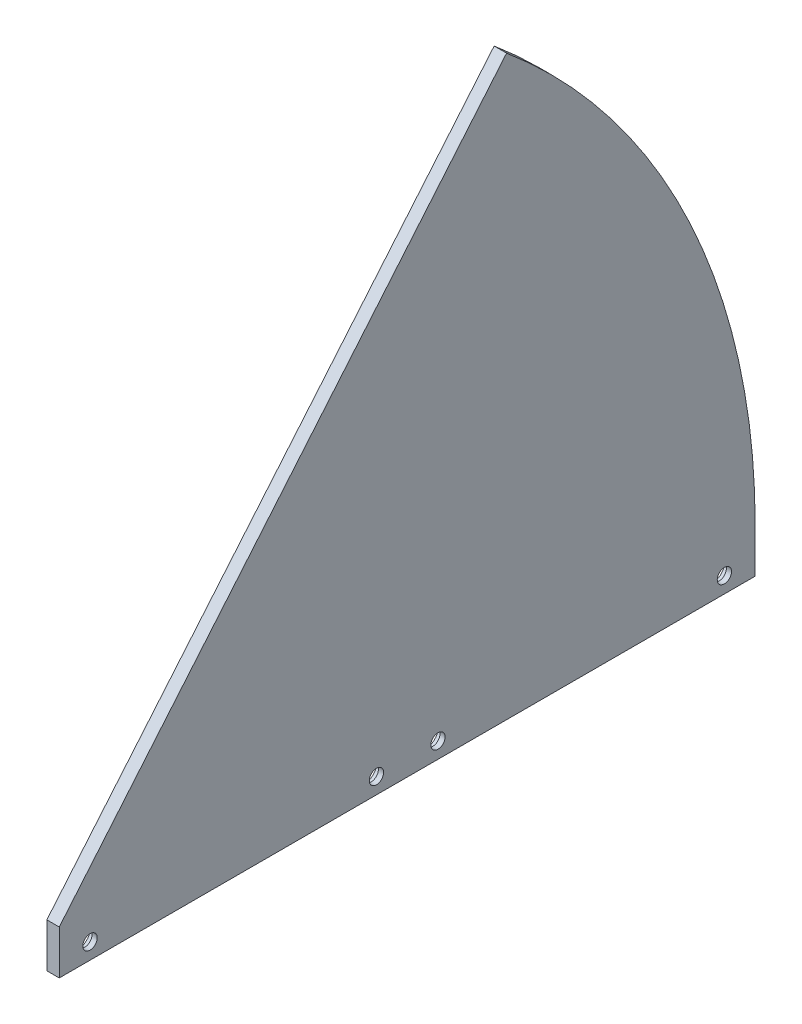
ISO-10303-21;
HEADER;
FILE_DESCRIPTION(('STEP AP214'),'2;1');
FILE_NAME('part.step','',(''),(''),'','','');
FILE_SCHEMA(('AUTOMOTIVE_DESIGN { 1 0 10303 214 1 1 1 1 }'));
ENDSEC;
DATA;
#1=APPLICATION_CONTEXT('core data for automotive mechanical design processes');
#2=APPLICATION_PROTOCOL_DEFINITION('international standard','automotive_design',2000,#1);
#3=PRODUCT_CONTEXT('',#1,'mechanical');
#4=PRODUCT('Part','Part','',(#3));
#5=PRODUCT_RELATED_PRODUCT_CATEGORY('part','',(#4));
#6=PRODUCT_DEFINITION_FORMATION('','',#4);
#7=PRODUCT_DEFINITION_CONTEXT('part definition',#1,'design');
#8=PRODUCT_DEFINITION('design','',#6,#7);
#9=PRODUCT_DEFINITION_SHAPE('','',#8);
#10=(LENGTH_UNIT() NAMED_UNIT(*) SI_UNIT(.MILLI.,.METRE.));
#11=(NAMED_UNIT(*) PLANE_ANGLE_UNIT() SI_UNIT($,.RADIAN.));
#12=(NAMED_UNIT(*) SI_UNIT($,.STERADIAN.) SOLID_ANGLE_UNIT());
#13=UNCERTAINTY_MEASURE_WITH_UNIT(LENGTH_MEASURE(1.E-05),#10,'distance_accuracy_value','');
#14=(GEOMETRIC_REPRESENTATION_CONTEXT(3) GLOBAL_UNCERTAINTY_ASSIGNED_CONTEXT((#13)) GLOBAL_UNIT_ASSIGNED_CONTEXT((#10,
#11,#12)) REPRESENTATION_CONTEXT('',''));
#15=CARTESIAN_POINT('',(0.,0.,0.));
#16=DIRECTION('',(0.,0.,1.));
#17=DIRECTION('',(1.,0.,0.));
#18=AXIS2_PLACEMENT_3D('',#15,#16,#17);
#19=CARTESIAN_POINT('',(0.,-7.239,-7.874));
#20=DIRECTION('',(1.,0.,0.));
#21=DIRECTION('',(0.,0.,-1.));
#22=AXIS2_PLACEMENT_3D('',#19,#20,#21);
#23=CYLINDRICAL_SURFACE('',#22,1.8288);
#24=CARTESIAN_POINT('',(3.175,-7.239,-7.874));
#25=DIRECTION('',(1.,0.,0.));
#26=DIRECTION('',(0.,0.,-1.));
#27=AXIS2_PLACEMENT_3D('',#24,#25,#26);
#28=CIRCLE('',#27,1.8288);
#29=CARTESIAN_POINT('',(3.175,-7.239,-9.7028));
#30=VERTEX_POINT('',#29);
#31=EDGE_CURVE('E169',#30,#30,#28,.T.);
#32=ORIENTED_EDGE('',*,*,#31,.T.);
#33=EDGE_LOOP('',(#32));
#34=FACE_BOUND('',#33,.T.);
#35=CARTESIAN_POINT('',(1.8542,-7.239,-7.874));
#36=DIRECTION('',(-1.,0.,0.));
#37=DIRECTION('',(0.,0.,1.));
#38=AXIS2_PLACEMENT_3D('',#35,#36,#37);
#39=CIRCLE('',#38,1.8288);
#40=CARTESIAN_POINT('',(1.8542,-7.239,-6.0452));
#41=VERTEX_POINT('',#40);
#42=EDGE_CURVE('E37',#41,#41,#39,.F.);
#43=ORIENTED_EDGE('',*,*,#42,.F.);
#44=EDGE_LOOP('',(#43));
#45=FACE_BOUND('',#44,.T.);
#46=ADVANCED_FACE('F33',(#34,#45),#23,.F.);
#47=CARTESIAN_POINT('',(0.,-7.23899999999998,-81.153));
#48=DIRECTION('',(1.,0.,0.));
#49=DIRECTION('',(0.,0.,-1.));
#50=AXIS2_PLACEMENT_3D('',#47,#48,#49);
#51=CYLINDRICAL_SURFACE('',#50,1.8288);
#52=CARTESIAN_POINT('',(3.175,-7.23899999999998,-81.153));
#53=DIRECTION('',(1.,0.,0.));
#54=DIRECTION('',(0.,0.,-1.));
#55=AXIS2_PLACEMENT_3D('',#52,#53,#54);
#56=CIRCLE('',#55,1.8288);
#57=CARTESIAN_POINT('',(3.175,-7.23899999999998,-82.9818));
#58=VERTEX_POINT('',#57);
#59=EDGE_CURVE('E166',#58,#58,#56,.T.);
#60=ORIENTED_EDGE('',*,*,#59,.T.);
#61=EDGE_LOOP('',(#60));
#62=FACE_BOUND('',#61,.T.);
#63=CARTESIAN_POINT('',(1.8542,-7.23899999999998,-81.153));
#64=DIRECTION('',(-1.,0.,0.));
#65=DIRECTION('',(0.,0.,1.));
#66=AXIS2_PLACEMENT_3D('',#63,#64,#65);
#67=CIRCLE('',#66,1.8288);
#68=CARTESIAN_POINT('',(1.8542,-7.23899999999998,-79.3242));
#69=VERTEX_POINT('',#68);
#70=EDGE_CURVE('E208',#69,#69,#67,.F.);
#71=ORIENTED_EDGE('',*,*,#70,.F.);
#72=EDGE_LOOP('',(#71));
#73=FACE_BOUND('',#72,.T.);
#74=ADVANCED_FACE('F291',(#62,#73),#51,.F.);
#75=CARTESIAN_POINT('',(0.,-7.23899999999998,-96.901));
#76=DIRECTION('',(1.,0.,0.));
#77=DIRECTION('',(0.,0.,-1.));
#78=AXIS2_PLACEMENT_3D('',#75,#76,#77);
#79=CYLINDRICAL_SURFACE('',#78,1.8288);
#80=CARTESIAN_POINT('',(3.175,-7.23899999999998,-96.901));
#81=DIRECTION('',(1.,0.,0.));
#82=DIRECTION('',(0.,0.,1.));
#83=AXIS2_PLACEMENT_3D('',#80,#81,#82);
#84=CIRCLE('',#83,1.8288);
#85=CARTESIAN_POINT('',(3.175,-7.23899999999998,-95.0722));
#86=VERTEX_POINT('',#85);
#87=EDGE_CURVE('E163',#86,#86,#84,.T.);
#88=ORIENTED_EDGE('',*,*,#87,.T.);
#89=EDGE_LOOP('',(#88));
#90=FACE_BOUND('',#89,.T.);
#91=CARTESIAN_POINT('',(1.8542,-7.23899999999998,-96.901));
#92=DIRECTION('',(-1.,0.,0.));
#93=DIRECTION('',(0.,0.,1.));
#94=AXIS2_PLACEMENT_3D('',#91,#92,#93);
#95=CIRCLE('',#94,1.8288);
#96=CARTESIAN_POINT('',(1.8542,-7.23899999999998,-95.0722));
#97=VERTEX_POINT('',#96);
#98=EDGE_CURVE('E204',#97,#97,#95,.F.);
#99=ORIENTED_EDGE('',*,*,#98,.F.);
#100=EDGE_LOOP('',(#99));
#101=FACE_BOUND('',#100,.T.);
#102=ADVANCED_FACE('F297',(#90,#101),#79,.F.);
#103=CARTESIAN_POINT('',(0.,-7.239,-170.18));
#104=DIRECTION('',(1.,0.,0.));
#105=DIRECTION('',(0.,0.,-1.));
#106=AXIS2_PLACEMENT_3D('',#103,#104,#105);
#107=CYLINDRICAL_SURFACE('',#106,1.82880000000001);
#108=CARTESIAN_POINT('',(3.175,-7.239,-170.18));
#109=DIRECTION('',(1.,0.,0.));
#110=DIRECTION('',(0.,0.,1.));
#111=AXIS2_PLACEMENT_3D('',#108,#109,#110);
#112=CIRCLE('',#111,1.82880000000001);
#113=CARTESIAN_POINT('',(3.175,-7.239,-168.3512));
#114=VERTEX_POINT('',#113);
#115=EDGE_CURVE('E160',#114,#114,#112,.T.);
#116=ORIENTED_EDGE('',*,*,#115,.T.);
#117=EDGE_LOOP('',(#116));
#118=FACE_BOUND('',#117,.T.);
#119=CARTESIAN_POINT('',(1.8542,-7.239,-170.18));
#120=DIRECTION('',(-1.,0.,0.));
#121=DIRECTION('',(0.,0.,1.));
#122=AXIS2_PLACEMENT_3D('',#119,#120,#121);
#123=CIRCLE('',#122,1.82880000000001);
#124=CARTESIAN_POINT('',(1.8542,-7.239,-168.3512));
#125=VERTEX_POINT('',#124);
#126=EDGE_CURVE('E136',#125,#125,#123,.F.);
#127=ORIENTED_EDGE('',*,*,#126,.F.);
#128=EDGE_LOOP('',(#127));
#129=FACE_BOUND('',#128,.T.);
#130=ADVANCED_FACE('F308',(#118,#129),#107,.F.);
#131=CARTESIAN_POINT('',(3.175,0.,0.));
#132=DIRECTION('',(1.,0.,0.));
#133=DIRECTION('',(0.,0.,-1.));
#134=AXIS2_PLACEMENT_3D('',#131,#132,#133);
#135=PLANE('',#134);
#136=DIRECTION('',(0.,1.,0.));
#137=VECTOR('',#136,1.);
#138=CARTESIAN_POINT('',(3.175,-11.303,0.));
#139=LINE('',#138,#137);
#140=CARTESIAN_POINT('',(3.175,-11.303,0.));
#141=VERTEX_POINT('',#140);
#142=CARTESIAN_POINT('',(3.175,0.,0.));
#143=VERTEX_POINT('',#142);
#144=EDGE_CURVE('E185',#141,#143,#139,.T.);
#145=ORIENTED_EDGE('',*,*,#144,.F.);
#146=DIRECTION('',(0.,0.,1.));
#147=VECTOR('',#146,1.);
#148=CARTESIAN_POINT('',(3.175,-11.303,-178.054));
#149=LINE('',#148,#147);
#150=CARTESIAN_POINT('',(3.175,-11.303,-178.054));
#151=VERTEX_POINT('',#150);
#152=EDGE_CURVE('E178',#151,#141,#149,.T.);
#153=ORIENTED_EDGE('',*,*,#152,.F.);
#154=DIRECTION('',(0.,1.,0.));
#155=VECTOR('',#154,1.);
#156=CARTESIAN_POINT('',(3.175,-11.303,-178.054));
#157=LINE('',#156,#155);
#158=CARTESIAN_POINT('',(3.175,0.,-178.054));
#159=VERTEX_POINT('',#158);
#160=EDGE_CURVE('E188',#151,#159,#157,.T.);
#161=ORIENTED_EDGE('',*,*,#160,.T.);
#162=CARTESIAN_POINT('',(3.175,0.,0.));
#163=DIRECTION('',(1.,0.,0.));
#164=DIRECTION('',(0.,0.,-1.));
#165=AXIS2_PLACEMENT_3D('',#162,#163,#164);
#166=CIRCLE('',#165,178.054);
#167=CARTESIAN_POINT('',(3.175,136.397277275107,-114.450905055127));
#168=VERTEX_POINT('',#167);
#169=EDGE_CURVE('E59',#159,#168,#166,.T.);
#170=ORIENTED_EDGE('',*,*,#169,.T.);
#171=DIRECTION('',(0.,-0.766044443118979,0.642787609686538));
#172=VECTOR('',#171,1.);
#173=CARTESIAN_POINT('',(3.175,0.,0.));
#174=LINE('',#173,#172);
#175=EDGE_CURVE('E76',#168,#143,#174,.T.);
#176=ORIENTED_EDGE('',*,*,#175,.T.);
#177=EDGE_LOOP('',(#145,#153,#161,#170,#176));
#178=FACE_BOUND('',#177,.T.);
#179=ORIENTED_EDGE('',*,*,#31,.F.);
#180=EDGE_LOOP('',(#179));
#181=FACE_BOUND('',#180,.T.);
#182=ORIENTED_EDGE('',*,*,#59,.F.);
#183=EDGE_LOOP('',(#182));
#184=FACE_BOUND('',#183,.T.);
#185=ORIENTED_EDGE('',*,*,#87,.F.);
#186=EDGE_LOOP('',(#185));
#187=FACE_BOUND('',#186,.T.);
#188=ORIENTED_EDGE('',*,*,#115,.F.);
#189=EDGE_LOOP('',(#188));
#190=FACE_BOUND('',#189,.T.);
#191=ADVANCED_FACE('F274',(#178,#181,#184,#187,#190),#135,.T.);
#192=CARTESIAN_POINT('',(0.,0.,0.));
#193=DIRECTION('',(1.,0.,0.));
#194=DIRECTION('',(0.,0.,-1.));
#195=AXIS2_PLACEMENT_3D('',#192,#193,#194);
#196=PLANE('',#195);
#197=CARTESIAN_POINT('',(0.,-7.239,-7.874));
#198=DIRECTION('',(-1.,0.,0.));
#199=DIRECTION('',(0.,0.,1.));
#200=AXIS2_PLACEMENT_3D('',#197,#198,#199);
#201=CIRCLE('',#200,3.3274);
#202=CARTESIAN_POINT('',(0.,-7.239,-4.5466));
#203=VERTEX_POINT('',#202);
#204=EDGE_CURVE('E224',#203,#203,#201,.T.);
#205=ORIENTED_EDGE('',*,*,#204,.F.);
#206=EDGE_LOOP('',(#205));
#207=FACE_BOUND('',#206,.T.);
#208=CARTESIAN_POINT('',(0.,-7.23899999999998,-81.153));
#209=DIRECTION('',(-1.,0.,0.));
#210=DIRECTION('',(0.,0.,1.));
#211=AXIS2_PLACEMENT_3D('',#208,#209,#210);
#212=CIRCLE('',#211,3.3274);
#213=CARTESIAN_POINT('',(0.,-7.23899999999998,-77.8256));
#214=VERTEX_POINT('',#213);
#215=EDGE_CURVE('E217',#214,#214,#212,.T.);
#216=ORIENTED_EDGE('',*,*,#215,.F.);
#217=EDGE_LOOP('',(#216));
#218=FACE_BOUND('',#217,.T.);
#219=CARTESIAN_POINT('',(0.,-7.23899999999998,-96.901));
#220=DIRECTION('',(-1.,0.,0.));
#221=DIRECTION('',(0.,0.,1.));
#222=AXIS2_PLACEMENT_3D('',#219,#220,#221);
#223=CIRCLE('',#222,3.3274);
#224=CARTESIAN_POINT('',(0.,-7.23899999999998,-93.5736));
#225=VERTEX_POINT('',#224);
#226=EDGE_CURVE('E210',#225,#225,#223,.T.);
#227=ORIENTED_EDGE('',*,*,#226,.F.);
#228=EDGE_LOOP('',(#227));
#229=FACE_BOUND('',#228,.T.);
#230=CARTESIAN_POINT('',(0.,-7.239,-170.18));
#231=DIRECTION('',(-1.,0.,0.));
#232=DIRECTION('',(0.,0.,1.));
#233=AXIS2_PLACEMENT_3D('',#230,#231,#232);
#234=CIRCLE('',#233,3.32740000000002);
#235=CARTESIAN_POINT('',(0.,-7.239,-166.8526));
#236=VERTEX_POINT('',#235);
#237=EDGE_CURVE('E206',#236,#236,#234,.T.);
#238=ORIENTED_EDGE('',*,*,#237,.F.);
#239=EDGE_LOOP('',(#238));
#240=FACE_BOUND('',#239,.T.);
#241=DIRECTION('',(0.,0.989324172843865,-0.145731537516086));
#242=VECTOR('',#241,1.);
#243=CARTESIAN_POINT('',(0.,-11.303,-160.260021407787));
#244=LINE('',#243,#242);
#245=CARTESIAN_POINT('',(0.,-11.303,-160.260021407787));
#246=VERTEX_POINT('',#245);
#247=CARTESIAN_POINT('',(0.,0.,-161.925));
#248=VERTEX_POINT('',#247);
#249=EDGE_CURVE('E241',#246,#248,#244,.T.);
#250=ORIENTED_EDGE('',*,*,#249,.F.);
#251=DIRECTION('',(0.,0.,-1.));
#252=VECTOR('',#251,1.);
#253=CARTESIAN_POINT('',(0.,-11.303,-178.054));
#254=LINE('',#253,#252);
#255=CARTESIAN_POINT('',(0.,-11.303,0.));
#256=VERTEX_POINT('',#255);
#257=EDGE_CURVE('E173',#256,#246,#254,.T.);
#258=ORIENTED_EDGE('',*,*,#257,.F.);
#259=DIRECTION('',(0.,1.,0.));
#260=VECTOR('',#259,1.);
#261=CARTESIAN_POINT('',(0.,-11.303,0.));
#262=LINE('',#261,#260);
#263=CARTESIAN_POINT('',(0.,0.,0.));
#264=VERTEX_POINT('',#263);
#265=EDGE_CURVE('E182',#256,#264,#262,.T.);
#266=ORIENTED_EDGE('',*,*,#265,.T.);
#267=DIRECTION('',(0.,-0.766044443118979,0.642787609686538));
#268=VECTOR('',#267,1.);
#269=CARTESIAN_POINT('',(0.,0.,0.));
#270=LINE('',#269,#268);
#271=CARTESIAN_POINT('',(0.,136.397277275107,-114.450905055127));
#272=VERTEX_POINT('',#271);
#273=EDGE_CURVE('E193',#272,#264,#270,.T.);
#274=ORIENTED_EDGE('',*,*,#273,.F.);
#275=CARTESIAN_POINT('',(0.,0.,0.));
#276=DIRECTION('',(1.,0.,0.));
#277=DIRECTION('',(0.,0.,-1.));
#278=AXIS2_PLACEMENT_3D('',#275,#276,#277);
#279=CIRCLE('',#278,178.054);
#280=CARTESIAN_POINT('',(0.,0.,-178.054));
#281=VERTEX_POINT('',#280);
#282=EDGE_CURVE('E72',#281,#272,#279,.T.);
#283=ORIENTED_EDGE('',*,*,#282,.F.);
#284=DIRECTION('',(0.,1.,0.));
#285=VECTOR('',#284,1.);
#286=CARTESIAN_POINT('',(0.,-11.303,-178.054));
#287=LINE('',#286,#285);
#288=CARTESIAN_POINT('',(0.,-11.303,-178.054));
#289=VERTEX_POINT('',#288);
#290=EDGE_CURVE('E190',#289,#281,#287,.T.);
#291=ORIENTED_EDGE('',*,*,#290,.F.);
#292=CARTESIAN_POINT('',(0.,-11.303,-165.98263518929));
#293=VERTEX_POINT('',#292);
#294=EDGE_CURVE('E172',#293,#289,#254,.T.);
#295=ORIENTED_EDGE('',*,*,#294,.F.);
#296=DIRECTION('',(0.,-0.996964960372701,-0.077851575379422));
#297=VECTOR('',#296,1.);
#298=CARTESIAN_POINT('',(0.,0.,-165.1));
#299=LINE('',#298,#297);
#300=CARTESIAN_POINT('',(0.,0.,-165.1));
#301=VERTEX_POINT('',#300);
#302=EDGE_CURVE('E50',#301,#293,#299,.T.);
#303=ORIENTED_EDGE('',*,*,#302,.F.);
#304=CARTESIAN_POINT('',(0.,0.,0.));
#305=DIRECTION('',(1.,0.,0.));
#306=DIRECTION('',(0.,0.,-1.));
#307=AXIS2_PLACEMENT_3D('',#304,#305,#306);
#308=CIRCLE('',#307,165.1);
#309=CARTESIAN_POINT('',(0.,112.597929246319,-120.746496137325));
#310=VERTEX_POINT('',#309);
#311=EDGE_CURVE('E146',#301,#310,#308,.T.);
#312=ORIENTED_EDGE('',*,*,#311,.T.);
#313=DIRECTION('',(0.,-0.681998360062499,0.73135370161917));
#314=VECTOR('',#313,1.);
#315=CARTESIAN_POINT('',(0.,112.597929246319,-120.746496137325));
#316=LINE('',#315,#314);
#317=CARTESIAN_POINT('',(0.,110.43258445312,-118.424448134684));
#318=VERTEX_POINT('',#317);
#319=EDGE_CURVE('E245',#310,#318,#316,.T.);
#320=ORIENTED_EDGE('',*,*,#319,.T.);
#321=CARTESIAN_POINT('',(0.,0.,0.));
#322=DIRECTION('',(1.,0.,0.));
#323=DIRECTION('',(0.,0.,-1.));
#324=AXIS2_PLACEMENT_3D('',#321,#322,#323);
#325=CIRCLE('',#324,161.925);
#326=EDGE_CURVE('E243',#248,#318,#325,.T.);
#327=ORIENTED_EDGE('',*,*,#326,.F.);
#328=EDGE_LOOP('',(#250,#258,#266,#274,#283,#291,#295,#303,#312,#320,#327));
#329=FACE_BOUND('',#328,.T.);
#330=ADVANCED_FACE('F259',(#207,#218,#229,#240,#329),#196,.F.);
#331=CARTESIAN_POINT('',(0.,-11.303,0.));
#332=DIRECTION('',(0.,1.,0.));
#333=DIRECTION('',(0.,0.,1.));
#334=AXIS2_PLACEMENT_3D('',#331,#332,#333);
#335=PLANE('',#334);
#336=DIRECTION('',(1.,0.,0.));
#337=VECTOR('',#336,1.);
#338=CARTESIAN_POINT('',(0.,-11.303,-165.98263518929));
#339=LINE('',#338,#337);
#340=CARTESIAN_POINT('',(2.54,-11.303,-165.98263518929));
#341=VERTEX_POINT('',#340);
#342=EDGE_CURVE('E141',#293,#341,#339,.T.);
#343=ORIENTED_EDGE('',*,*,#342,.F.);
#344=ORIENTED_EDGE('',*,*,#294,.T.);
#345=DIRECTION('',(1.,0.,0.));
#346=VECTOR('',#345,1.);
#347=CARTESIAN_POINT('',(0.,-11.303,-178.054));
#348=LINE('',#347,#346);
#349=EDGE_CURVE('E176',#289,#151,#348,.T.);
#350=ORIENTED_EDGE('',*,*,#349,.T.);
#351=ORIENTED_EDGE('',*,*,#152,.T.);
#352=DIRECTION('',(-1.,0.,0.));
#353=VECTOR('',#352,1.);
#354=CARTESIAN_POINT('',(0.,-11.303,0.));
#355=LINE('',#354,#353);
#356=EDGE_CURVE('E180',#141,#256,#355,.T.);
#357=ORIENTED_EDGE('',*,*,#356,.T.);
#358=ORIENTED_EDGE('',*,*,#257,.T.);
#359=DIRECTION('',(1.,0.,0.));
#360=VECTOR('',#359,1.);
#361=CARTESIAN_POINT('',(0.,-11.303,-160.260021407787));
#362=LINE('',#361,#360);
#363=CARTESIAN_POINT('',(2.54,-11.303,-160.260021407787));
#364=VERTEX_POINT('',#363);
#365=EDGE_CURVE('E151',#246,#364,#362,.T.);
#366=ORIENTED_EDGE('',*,*,#365,.T.);
#367=DIRECTION('',(0.,0.,-1.));
#368=VECTOR('',#367,1.);
#369=CARTESIAN_POINT('',(2.54,-11.303,-160.260021407787));
#370=LINE('',#369,#368);
#371=EDGE_CURVE('E142',#364,#341,#370,.T.);
#372=ORIENTED_EDGE('',*,*,#371,.T.);
#373=EDGE_LOOP('',(#343,#344,#350,#351,#357,#358,#366,#372));
#374=FACE_BOUND('',#373,.T.);
#375=ADVANCED_FACE('F251',(#374),#335,.F.);
#376=CARTESIAN_POINT('',(3.175,0.,0.));
#377=DIRECTION('',(0.,-0.642787609686538,-0.766044443118979));
#378=DIRECTION('',(0.,0.766044443118979,-0.642787609686538));
#379=AXIS2_PLACEMENT_3D('',#376,#377,#378);
#380=PLANE('',#379);
#381=ORIENTED_EDGE('',*,*,#273,.T.);
#382=DIRECTION('',(-1.,0.,0.));
#383=VECTOR('',#382,1.);
#384=CARTESIAN_POINT('',(3.175,0.,0.));
#385=LINE('',#384,#383);
#386=EDGE_CURVE('E11',#143,#264,#385,.T.);
#387=ORIENTED_EDGE('',*,*,#386,.F.);
#388=ORIENTED_EDGE('',*,*,#175,.F.);
#389=DIRECTION('',(-1.,0.,0.));
#390=VECTOR('',#389,1.);
#391=CARTESIAN_POINT('',(3.175,136.397277275107,-114.450905055127));
#392=LINE('',#391,#390);
#393=EDGE_CURVE('E196',#168,#272,#392,.T.);
#394=ORIENTED_EDGE('',*,*,#393,.T.);
#395=EDGE_LOOP('',(#381,#387,#388,#394));
#396=FACE_BOUND('',#395,.T.);
#397=ADVANCED_FACE('F35',(#396),#380,.F.);
#398=CARTESIAN_POINT('',(3.175,0.,0.));
#399=DIRECTION('',(-1.,0.,0.));
#400=DIRECTION('',(0.,0.,1.));
#401=AXIS2_PLACEMENT_3D('',#398,#399,#400);
#402=CYLINDRICAL_SURFACE('',#401,178.054);
#403=ORIENTED_EDGE('',*,*,#282,.T.);
#404=ORIENTED_EDGE('',*,*,#393,.F.);
#405=ORIENTED_EDGE('',*,*,#169,.F.);
#406=DIRECTION('',(-1.,0.,0.));
#407=VECTOR('',#406,1.);
#408=CARTESIAN_POINT('',(3.175,0.,-178.054));
#409=LINE('',#408,#407);
#410=EDGE_CURVE('E42',#159,#281,#409,.T.);
#411=ORIENTED_EDGE('',*,*,#410,.T.);
#412=EDGE_LOOP('',(#403,#404,#405,#411));
#413=FACE_BOUND('',#412,.T.);
#414=ADVANCED_FACE('F282',(#413),#402,.T.);
#415=CARTESIAN_POINT('',(0.,-11.303,-178.054));
#416=DIRECTION('',(0.,0.,1.));
#417=DIRECTION('',(1.,0.,0.));
#418=AXIS2_PLACEMENT_3D('',#415,#416,#417);
#419=PLANE('',#418);
#420=ORIENTED_EDGE('',*,*,#410,.F.);
#421=ORIENTED_EDGE('',*,*,#160,.F.);
#422=ORIENTED_EDGE('',*,*,#349,.F.);
#423=ORIENTED_EDGE('',*,*,#290,.T.);
#424=EDGE_LOOP('',(#420,#421,#422,#423));
#425=FACE_BOUND('',#424,.T.);
#426=ADVANCED_FACE('F272',(#425),#419,.F.);
#427=CARTESIAN_POINT('',(0.,-11.303,0.));
#428=DIRECTION('',(0.,0.,-1.));
#429=DIRECTION('',(-1.,0.,0.));
#430=AXIS2_PLACEMENT_3D('',#427,#428,#429);
#431=PLANE('',#430);
#432=ORIENTED_EDGE('',*,*,#386,.T.);
#433=ORIENTED_EDGE('',*,*,#265,.F.);
#434=ORIENTED_EDGE('',*,*,#356,.F.);
#435=ORIENTED_EDGE('',*,*,#144,.T.);
#436=EDGE_LOOP('',(#432,#433,#434,#435));
#437=FACE_BOUND('',#436,.T.);
#438=ADVANCED_FACE('F279',(#437),#431,.F.);
#439=CARTESIAN_POINT('',(0.,-11.303,-160.260021407787));
#440=DIRECTION('',(0.,-0.145731537516086,-0.989324172843865));
#441=DIRECTION('',(0.,0.989324172843865,-0.145731537516086));
#442=AXIS2_PLACEMENT_3D('',#439,#440,#441);
#443=PLANE('',#442);
#444=DIRECTION('',(0.,-0.989324172843865,0.145731537516086));
#445=VECTOR('',#444,1.);
#446=CARTESIAN_POINT('',(2.54,0.,-161.925));
#447=LINE('',#446,#445);
#448=CARTESIAN_POINT('',(2.54,0.,-161.925));
#449=VERTEX_POINT('',#448);
#450=EDGE_CURVE('E234',#449,#364,#447,.T.);
#451=ORIENTED_EDGE('',*,*,#450,.T.);
#452=ORIENTED_EDGE('',*,*,#365,.F.);
#453=ORIENTED_EDGE('',*,*,#249,.T.);
#454=DIRECTION('',(1.,0.,0.));
#455=VECTOR('',#454,1.);
#456=CARTESIAN_POINT('',(0.,0.,-161.925));
#457=LINE('',#456,#455);
#458=EDGE_CURVE('E157',#248,#449,#457,.T.);
#459=ORIENTED_EDGE('',*,*,#458,.T.);
#460=EDGE_LOOP('',(#451,#452,#453,#459));
#461=FACE_BOUND('',#460,.T.);
#462=ADVANCED_FACE('F255',(#461),#443,.T.);
#463=CARTESIAN_POINT('',(0.,0.,0.));
#464=DIRECTION('',(1.,0.,0.));
#465=DIRECTION('',(0.,0.,-1.));
#466=AXIS2_PLACEMENT_3D('',#463,#464,#465);
#467=CYLINDRICAL_SURFACE('',#466,161.925);
#468=CARTESIAN_POINT('',(2.54,-5.06539254985228E-13,1.33226762955019E-12));
#469=DIRECTION('',(-1.,0.,0.));
#470=DIRECTION('',(0.,0.,1.));
#471=AXIS2_PLACEMENT_3D('',#468,#469,#470);
#472=CIRCLE('',#471,161.925000000001);
#473=CARTESIAN_POINT('',(2.54,110.43258445312,-118.424448134684));
#474=VERTEX_POINT('',#473);
#475=EDGE_CURVE('E237',#474,#449,#472,.T.);
#476=ORIENTED_EDGE('',*,*,#475,.T.);
#477=ORIENTED_EDGE('',*,*,#458,.F.);
#478=ORIENTED_EDGE('',*,*,#326,.T.);
#479=DIRECTION('',(1.,0.,0.));
#480=VECTOR('',#479,1.);
#481=CARTESIAN_POINT('',(0.,110.43258445312,-118.424448134684));
#482=LINE('',#481,#480);
#483=EDGE_CURVE('E149',#318,#474,#482,.T.);
#484=ORIENTED_EDGE('',*,*,#483,.T.);
#485=EDGE_LOOP('',(#476,#477,#478,#484));
#486=FACE_BOUND('',#485,.T.);
#487=ADVANCED_FACE('F263',(#486),#467,.T.);
#488=CARTESIAN_POINT('',(0.,112.597929246319,-120.746496137325));
#489=DIRECTION('',(0.,0.73135370161917,0.681998360062499));
#490=DIRECTION('',(0.,-0.681998360062499,0.73135370161917));
#491=AXIS2_PLACEMENT_3D('',#488,#489,#490);
#492=PLANE('',#491);
#493=DIRECTION('',(1.,0.,0.));
#494=VECTOR('',#493,1.);
#495=CARTESIAN_POINT('',(0.,112.597929246319,-120.746496137325));
#496=LINE('',#495,#494);
#497=CARTESIAN_POINT('',(2.54,112.597929246319,-120.746496137325));
#498=VERTEX_POINT('',#497);
#499=EDGE_CURVE('E147',#310,#498,#496,.T.);
#500=ORIENTED_EDGE('',*,*,#499,.T.);
#501=DIRECTION('',(0.,0.681998360062503,-0.731353701619166));
#502=VECTOR('',#501,1.);
#503=CARTESIAN_POINT('',(2.54,110.43258445312,-118.424448134684));
#504=LINE('',#503,#502);
#505=EDGE_CURVE('E132',#474,#498,#504,.T.);
#506=ORIENTED_EDGE('',*,*,#505,.F.);
#507=ORIENTED_EDGE('',*,*,#483,.F.);
#508=ORIENTED_EDGE('',*,*,#319,.F.);
#509=EDGE_LOOP('',(#500,#506,#507,#508));
#510=FACE_BOUND('',#509,.T.);
#511=ADVANCED_FACE('F265',(#510),#492,.F.);
#512=CARTESIAN_POINT('',(0.,0.,0.));
#513=DIRECTION('',(1.,0.,0.));
#514=DIRECTION('',(0.,0.,-1.));
#515=AXIS2_PLACEMENT_3D('',#512,#513,#514);
#516=CYLINDRICAL_SURFACE('',#515,165.1);
#517=DIRECTION('',(1.,0.,0.));
#518=VECTOR('',#517,1.);
#519=CARTESIAN_POINT('',(0.,0.,-165.1));
#520=LINE('',#519,#518);
#521=CARTESIAN_POINT('',(2.54,0.,-165.1));
#522=VERTEX_POINT('',#521);
#523=EDGE_CURVE('E139',#301,#522,#520,.T.);
#524=ORIENTED_EDGE('',*,*,#523,.T.);
#525=CARTESIAN_POINT('',(2.54,-7.42461647718073E-13,1.83186799063151E-12));
#526=DIRECTION('',(-1.,0.,0.));
#527=DIRECTION('',(0.,0.,1.));
#528=AXIS2_PLACEMENT_3D('',#525,#526,#527);
#529=CIRCLE('',#528,165.100000000002);
#530=EDGE_CURVE('E126',#498,#522,#529,.T.);
#531=ORIENTED_EDGE('',*,*,#530,.F.);
#532=ORIENTED_EDGE('',*,*,#499,.F.);
#533=ORIENTED_EDGE('',*,*,#311,.F.);
#534=EDGE_LOOP('',(#524,#531,#532,#533));
#535=FACE_BOUND('',#534,.T.);
#536=ADVANCED_FACE('F144',(#535),#516,.F.);
#537=CARTESIAN_POINT('',(0.,0.,-165.1));
#538=DIRECTION('',(0.,-0.077851575379422,0.996964960372701));
#539=DIRECTION('',(0.,-0.996964960372702,-0.077851575379422));
#540=AXIS2_PLACEMENT_3D('',#537,#538,#539);
#541=PLANE('',#540);
#542=DIRECTION('',(0.,0.996964960372701,0.077851575379422));
#543=VECTOR('',#542,1.);
#544=CARTESIAN_POINT('',(2.54,-11.303,-165.98263518929));
#545=LINE('',#544,#543);
#546=EDGE_CURVE('E129',#341,#522,#545,.T.);
#547=ORIENTED_EDGE('',*,*,#546,.T.);
#548=ORIENTED_EDGE('',*,*,#523,.F.);
#549=ORIENTED_EDGE('',*,*,#302,.T.);
#550=ORIENTED_EDGE('',*,*,#342,.T.);
#551=EDGE_LOOP('',(#547,#548,#549,#550));
#552=FACE_BOUND('',#551,.T.);
#553=ADVANCED_FACE('F138',(#552),#541,.T.);
#554=CARTESIAN_POINT('',(2.54,-7.42461647718073E-13,1.83186799063151E-12));
#555=DIRECTION('',(-1.,0.,0.));
#556=DIRECTION('',(0.,0.,1.));
#557=AXIS2_PLACEMENT_3D('',#554,#555,#556);
#558=PLANE('',#557);
#559=ORIENTED_EDGE('',*,*,#530,.T.);
#560=ORIENTED_EDGE('',*,*,#546,.F.);
#561=ORIENTED_EDGE('',*,*,#371,.F.);
#562=ORIENTED_EDGE('',*,*,#450,.F.);
#563=ORIENTED_EDGE('',*,*,#475,.F.);
#564=ORIENTED_EDGE('',*,*,#505,.T.);
#565=EDGE_LOOP('',(#559,#560,#561,#562,#563,#564));
#566=FACE_BOUND('',#565,.T.);
#567=ADVANCED_FACE('F128',(#566),#558,.T.);
#568=CARTESIAN_POINT('',(1.8542,-7.239,-170.18));
#569=DIRECTION('',(-1.,0.,0.));
#570=DIRECTION('',(0.,0.,1.));
#571=AXIS2_PLACEMENT_3D('',#568,#569,#570);
#572=PLANE('',#571);
#573=CARTESIAN_POINT('',(1.8542,-7.239,-170.18));
#574=DIRECTION('',(-1.,0.,0.));
#575=DIRECTION('',(0.,0.,1.));
#576=AXIS2_PLACEMENT_3D('',#573,#574,#575);
#577=CIRCLE('',#576,3.32740000000002);
#578=CARTESIAN_POINT('',(1.8542,-7.239,-166.8526));
#579=VERTEX_POINT('',#578);
#580=EDGE_CURVE('E203',#579,#579,#577,.T.);
#581=ORIENTED_EDGE('',*,*,#580,.T.);
#582=EDGE_LOOP('',(#581));
#583=FACE_BOUND('',#582,.T.);
#584=ORIENTED_EDGE('',*,*,#126,.T.);
#585=EDGE_LOOP('',(#584));
#586=FACE_BOUND('',#585,.T.);
#587=ADVANCED_FACE('F325',(#583,#586),#572,.T.);
#588=CARTESIAN_POINT('',(1.8542,-7.239,-170.18));
#589=DIRECTION('',(-1.,0.,0.));
#590=DIRECTION('',(0.,0.,1.));
#591=AXIS2_PLACEMENT_3D('',#588,#589,#590);
#592=CYLINDRICAL_SURFACE('',#591,3.32740000000002);
#593=ORIENTED_EDGE('',*,*,#580,.F.);
#594=EDGE_LOOP('',(#593));
#595=FACE_BOUND('',#594,.T.);
#596=ORIENTED_EDGE('',*,*,#237,.T.);
#597=EDGE_LOOP('',(#596));
#598=FACE_BOUND('',#597,.T.);
#599=ADVANCED_FACE('F322',(#595,#598),#592,.F.);
#600=CARTESIAN_POINT('',(1.8542,-7.23899999999998,-96.901));
#601=DIRECTION('',(-1.,0.,0.));
#602=DIRECTION('',(0.,0.,1.));
#603=AXIS2_PLACEMENT_3D('',#600,#601,#602);
#604=PLANE('',#603);
#605=CARTESIAN_POINT('',(1.8542,-7.23899999999998,-96.901));
#606=DIRECTION('',(-1.,0.,0.));
#607=DIRECTION('',(0.,0.,1.));
#608=AXIS2_PLACEMENT_3D('',#605,#606,#607);
#609=CIRCLE('',#608,3.3274);
#610=CARTESIAN_POINT('',(1.8542,-7.23899999999998,-93.5736));
#611=VERTEX_POINT('',#610);
#612=EDGE_CURVE('E207',#611,#611,#609,.T.);
#613=ORIENTED_EDGE('',*,*,#612,.T.);
#614=EDGE_LOOP('',(#613));
#615=FACE_BOUND('',#614,.T.);
#616=ORIENTED_EDGE('',*,*,#98,.T.);
#617=EDGE_LOOP('',(#616));
#618=FACE_BOUND('',#617,.T.);
#619=ADVANCED_FACE('F324',(#615,#618),#604,.T.);
#620=CARTESIAN_POINT('',(1.8542,-7.23899999999998,-96.901));
#621=DIRECTION('',(-1.,0.,0.));
#622=DIRECTION('',(0.,0.,1.));
#623=AXIS2_PLACEMENT_3D('',#620,#621,#622);
#624=CYLINDRICAL_SURFACE('',#623,3.3274);
#625=ORIENTED_EDGE('',*,*,#612,.F.);
#626=EDGE_LOOP('',(#625));
#627=FACE_BOUND('',#626,.T.);
#628=ORIENTED_EDGE('',*,*,#226,.T.);
#629=EDGE_LOOP('',(#628));
#630=FACE_BOUND('',#629,.T.);
#631=ADVANCED_FACE('F332',(#627,#630),#624,.F.);
#632=CARTESIAN_POINT('',(1.8542,-7.23899999999998,-81.153));
#633=DIRECTION('',(-1.,0.,0.));
#634=DIRECTION('',(0.,0.,1.));
#635=AXIS2_PLACEMENT_3D('',#632,#633,#634);
#636=PLANE('',#635);
#637=CARTESIAN_POINT('',(1.8542,-7.23899999999998,-81.153));
#638=DIRECTION('',(-1.,0.,0.));
#639=DIRECTION('',(0.,0.,1.));
#640=AXIS2_PLACEMENT_3D('',#637,#638,#639);
#641=CIRCLE('',#640,3.3274);
#642=CARTESIAN_POINT('',(1.8542,-7.23899999999998,-77.8256));
#643=VERTEX_POINT('',#642);
#644=EDGE_CURVE('E211',#643,#643,#641,.T.);
#645=ORIENTED_EDGE('',*,*,#644,.T.);
#646=EDGE_LOOP('',(#645));
#647=FACE_BOUND('',#646,.T.);
#648=ORIENTED_EDGE('',*,*,#70,.T.);
#649=EDGE_LOOP('',(#648));
#650=FACE_BOUND('',#649,.T.);
#651=ADVANCED_FACE('F462',(#647,#650),#636,.T.);
#652=CARTESIAN_POINT('',(1.8542,-7.23899999999998,-81.153));
#653=DIRECTION('',(-1.,0.,0.));
#654=DIRECTION('',(0.,0.,1.));
#655=AXIS2_PLACEMENT_3D('',#652,#653,#654);
#656=CYLINDRICAL_SURFACE('',#655,3.3274);
#657=ORIENTED_EDGE('',*,*,#644,.F.);
#658=EDGE_LOOP('',(#657));
#659=FACE_BOUND('',#658,.T.);
#660=ORIENTED_EDGE('',*,*,#215,.T.);
#661=EDGE_LOOP('',(#660));
#662=FACE_BOUND('',#661,.T.);
#663=ADVANCED_FACE('F470',(#659,#662),#656,.F.);
#664=CARTESIAN_POINT('',(1.8542,-7.239,-7.874));
#665=DIRECTION('',(-1.,0.,0.));
#666=DIRECTION('',(0.,0.,1.));
#667=AXIS2_PLACEMENT_3D('',#664,#665,#666);
#668=PLANE('',#667);
#669=CARTESIAN_POINT('',(1.8542,-7.239,-7.874));
#670=DIRECTION('',(-1.,0.,0.));
#671=DIRECTION('',(0.,0.,1.));
#672=AXIS2_PLACEMENT_3D('',#669,#670,#671);
#673=CIRCLE('',#672,3.3274);
#674=CARTESIAN_POINT('',(1.8542,-7.239,-4.5466));
#675=VERTEX_POINT('',#674);
#676=EDGE_CURVE('E507',#675,#675,#673,.T.);
#677=ORIENTED_EDGE('',*,*,#676,.T.);
#678=EDGE_LOOP('',(#677));
#679=FACE_BOUND('',#678,.T.);
#680=ORIENTED_EDGE('',*,*,#42,.T.);
#681=EDGE_LOOP('',(#680));
#682=FACE_BOUND('',#681,.T.);
#683=ADVANCED_FACE('F478',(#679,#682),#668,.T.);
#684=CARTESIAN_POINT('',(1.8542,-7.239,-7.874));
#685=DIRECTION('',(-1.,0.,0.));
#686=DIRECTION('',(0.,0.,1.));
#687=AXIS2_PLACEMENT_3D('',#684,#685,#686);
#688=CYLINDRICAL_SURFACE('',#687,3.3274);
#689=ORIENTED_EDGE('',*,*,#676,.F.);
#690=EDGE_LOOP('',(#689));
#691=FACE_BOUND('',#690,.T.);
#692=ORIENTED_EDGE('',*,*,#204,.T.);
#693=EDGE_LOOP('',(#692));
#694=FACE_BOUND('',#693,.T.);
#695=ADVANCED_FACE('F487',(#691,#694),#688,.F.);
#696=CLOSED_SHELL('',(#46,#74,#102,#130,#191,#330,#375,#397,#414,#426,#438,#462,#487,#511,#536,
#553,#567,#587,#599,#619,#631,#651,#663,#683,#695));
#697=MANIFOLD_SOLID_BREP('B2',#696);
#698=ADVANCED_BREP_SHAPE_REPRESENTATION('',(#18,#697),#14);
#699=SHAPE_DEFINITION_REPRESENTATION(#9,#698);
ENDSEC;
END-ISO-10303-21;
